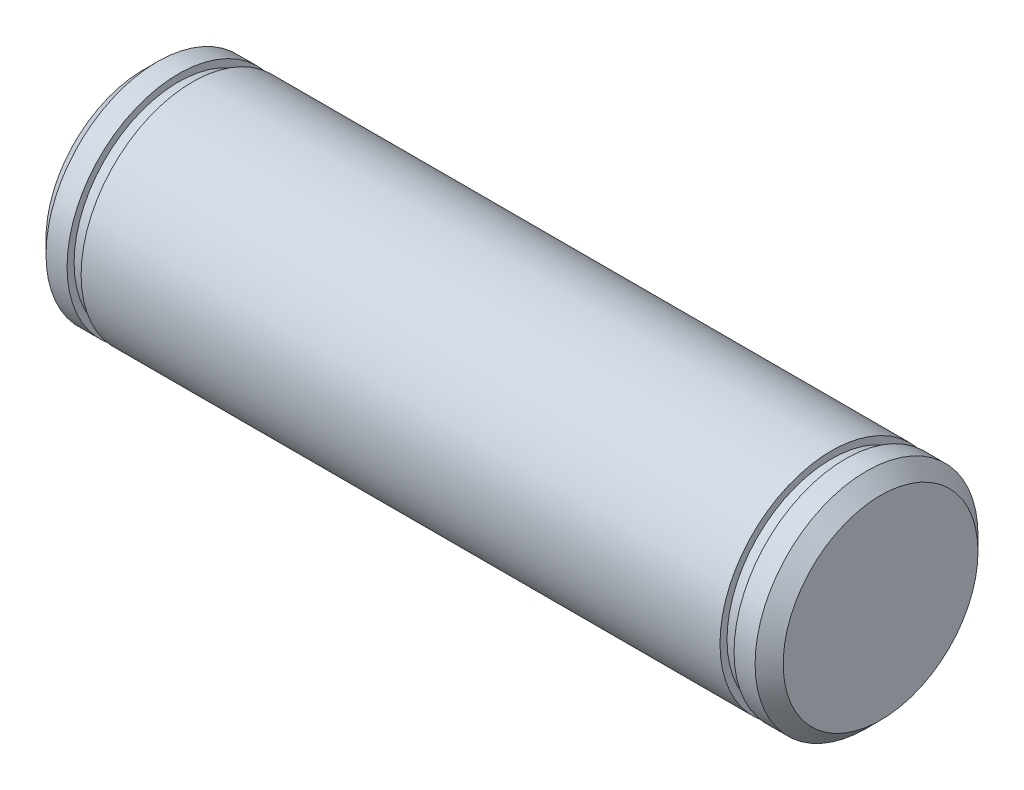
ISO-10303-21;
HEADER;
FILE_DESCRIPTION(('STEP AP214'),'2;1');
FILE_NAME('part.step','',(''),(''),'','','');
FILE_SCHEMA(('AUTOMOTIVE_DESIGN { 1 0 10303 214 1 1 1 1 }'));
ENDSEC;
DATA;
#1=APPLICATION_CONTEXT('core data for automotive mechanical design processes');
#2=APPLICATION_PROTOCOL_DEFINITION('international standard','automotive_design',2000,#1);
#3=PRODUCT_CONTEXT('',#1,'mechanical');
#4=PRODUCT('Part','Part','',(#3));
#5=PRODUCT_RELATED_PRODUCT_CATEGORY('part','',(#4));
#6=PRODUCT_DEFINITION_FORMATION('','',#4);
#7=PRODUCT_DEFINITION_CONTEXT('part definition',#1,'design');
#8=PRODUCT_DEFINITION('design','',#6,#7);
#9=PRODUCT_DEFINITION_SHAPE('','',#8);
#10=(LENGTH_UNIT() NAMED_UNIT(*) SI_UNIT(.MILLI.,.METRE.));
#11=(NAMED_UNIT(*) PLANE_ANGLE_UNIT() SI_UNIT($,.RADIAN.));
#12=(NAMED_UNIT(*) SI_UNIT($,.STERADIAN.) SOLID_ANGLE_UNIT());
#13=UNCERTAINTY_MEASURE_WITH_UNIT(LENGTH_MEASURE(1.E-05),#10,'distance_accuracy_value','');
#14=(GEOMETRIC_REPRESENTATION_CONTEXT(3) GLOBAL_UNCERTAINTY_ASSIGNED_CONTEXT((#13)) GLOBAL_UNIT_ASSIGNED_CONTEXT((#10,
#11,#12)) REPRESENTATION_CONTEXT('',''));
#15=CARTESIAN_POINT('',(0.,0.,0.));
#16=DIRECTION('',(0.,0.,1.));
#17=DIRECTION('',(1.,0.,0.));
#18=AXIS2_PLACEMENT_3D('',#15,#16,#17);
#19=CARTESIAN_POINT('',(52.5,0.,0.));
#20=DIRECTION('',(-1.,0.,0.));
#21=DIRECTION('',(0.,0.,1.));
#22=AXIS2_PLACEMENT_3D('',#19,#20,#21);
#23=CYLINDRICAL_SURFACE('',#22,15.875);
#24=CARTESIAN_POINT('',(-45.5,0.,0.));
#25=DIRECTION('',(-1.,0.,0.));
#26=DIRECTION('',(0.,0.,1.));
#27=AXIS2_PLACEMENT_3D('',#24,#25,#26);
#28=CIRCLE('',#27,15.875);
#29=CARTESIAN_POINT('',(-45.5,0.,15.875));
#30=VERTEX_POINT('',#29);
#31=EDGE_CURVE('E68',#30,#30,#28,.T.);
#32=ORIENTED_EDGE('',*,*,#31,.F.);
#33=EDGE_LOOP('',(#32));
#34=FACE_BOUND('',#33,.T.);
#35=CARTESIAN_POINT('',(45.5,0.,0.));
#36=DIRECTION('',(-1.,0.,0.));
#37=DIRECTION('',(0.,0.,1.));
#38=AXIS2_PLACEMENT_3D('',#35,#36,#37);
#39=CIRCLE('',#38,15.875);
#40=CARTESIAN_POINT('',(45.5,0.,15.875));
#41=VERTEX_POINT('',#40);
#42=EDGE_CURVE('E81',#41,#41,#39,.T.);
#43=ORIENTED_EDGE('',*,*,#42,.T.);
#44=EDGE_LOOP('',(#43));
#45=FACE_BOUND('',#44,.T.);
#46=ADVANCED_FACE('F43',(#34,#45),#23,.T.);
#47=CARTESIAN_POINT('',(-45.5,0.,0.));
#48=DIRECTION('',(-1.,0.,0.));
#49=DIRECTION('',(0.,0.,1.));
#50=AXIS2_PLACEMENT_3D('',#47,#48,#49);
#51=PLANE('',#50);
#52=CARTESIAN_POINT('',(-45.5,0.,0.));
#53=DIRECTION('',(-1.,0.,0.));
#54=DIRECTION('',(0.,0.,1.));
#55=AXIS2_PLACEMENT_3D('',#52,#53,#54);
#56=CIRCLE('',#55,14.875);
#57=CARTESIAN_POINT('',(-45.5,0.,14.875));
#58=VERTEX_POINT('',#57);
#59=EDGE_CURVE('E73',#58,#58,#56,.T.);
#60=ORIENTED_EDGE('',*,*,#59,.F.);
#61=EDGE_LOOP('',(#60));
#62=FACE_BOUND('',#61,.T.);
#63=ORIENTED_EDGE('',*,*,#31,.T.);
#64=EDGE_LOOP('',(#63));
#65=FACE_BOUND('',#64,.T.);
#66=ADVANCED_FACE('F122',(#62,#65),#51,.T.);
#67=CARTESIAN_POINT('',(-47.5,0.,0.));
#68=DIRECTION('',(-1.,0.,0.));
#69=DIRECTION('',(0.,0.,1.));
#70=AXIS2_PLACEMENT_3D('',#67,#68,#69);
#71=PLANE('',#70);
#72=CARTESIAN_POINT('',(-47.5,0.,0.));
#73=DIRECTION('',(-1.,0.,0.));
#74=DIRECTION('',(0.,0.,1.));
#75=AXIS2_PLACEMENT_3D('',#72,#73,#74);
#76=CIRCLE('',#75,14.875);
#77=CARTESIAN_POINT('',(-47.5,0.,14.875));
#78=VERTEX_POINT('',#77);
#79=EDGE_CURVE('E77',#78,#78,#76,.T.);
#80=ORIENTED_EDGE('',*,*,#79,.T.);
#81=EDGE_LOOP('',(#80));
#82=FACE_BOUND('',#81,.T.);
#83=CARTESIAN_POINT('',(-47.5,0.,0.));
#84=DIRECTION('',(-1.,0.,0.));
#85=DIRECTION('',(0.,0.,1.));
#86=AXIS2_PLACEMENT_3D('',#83,#84,#85);
#87=CIRCLE('',#86,15.875);
#88=CARTESIAN_POINT('',(-47.5,0.,15.875));
#89=VERTEX_POINT('',#88);
#90=EDGE_CURVE('E69',#89,#89,#87,.T.);
#91=ORIENTED_EDGE('',*,*,#90,.F.);
#92=EDGE_LOOP('',(#91));
#93=FACE_BOUND('',#92,.T.);
#94=ADVANCED_FACE('F129',(#82,#93),#71,.F.);
#95=CARTESIAN_POINT('',(-45.5,0.,0.));
#96=DIRECTION('',(-1.,0.,0.));
#97=DIRECTION('',(0.,0.,1.));
#98=AXIS2_PLACEMENT_3D('',#95,#96,#97);
#99=CYLINDRICAL_SURFACE('',#98,14.875);
#100=ORIENTED_EDGE('',*,*,#59,.T.);
#101=EDGE_LOOP('',(#100));
#102=FACE_BOUND('',#101,.T.);
#103=ORIENTED_EDGE('',*,*,#79,.F.);
#104=EDGE_LOOP('',(#103));
#105=FACE_BOUND('',#104,.T.);
#106=ADVANCED_FACE('F151',(#102,#105),#99,.T.);
#107=CARTESIAN_POINT('',(-52.5,0.,0.));
#108=DIRECTION('',(1.,0.,0.));
#109=DIRECTION('',(0.,0.,-1.));
#110=AXIS2_PLACEMENT_3D('',#107,#108,#109);
#111=PLANE('',#110);
#112=CARTESIAN_POINT('',(-52.5,0.,0.));
#113=DIRECTION('',(1.,0.,0.));
#114=DIRECTION('',(0.,0.,-1.));
#115=AXIS2_PLACEMENT_3D('',#112,#113,#114);
#116=CIRCLE('',#115,13.875);
#117=CARTESIAN_POINT('',(-52.5,0.,-13.875));
#118=VERTEX_POINT('',#117);
#119=EDGE_CURVE('E52',#118,#118,#116,.F.);
#120=ORIENTED_EDGE('',*,*,#119,.T.);
#121=EDGE_LOOP('',(#120));
#122=FACE_BOUND('',#121,.T.);
#123=ADVANCED_FACE('F143',(#122),#111,.F.);
#124=CARTESIAN_POINT('',(-50.5,0.,0.));
#125=DIRECTION('',(1.,0.,0.));
#126=DIRECTION('',(0.,0.,-1.));
#127=AXIS2_PLACEMENT_3D('',#124,#125,#126);
#128=CONICAL_SURFACE('',#127,15.875,0.785398163397453);
#129=ORIENTED_EDGE('',*,*,#119,.F.);
#130=EDGE_LOOP('',(#129));
#131=FACE_BOUND('',#130,.T.);
#132=CARTESIAN_POINT('',(-50.5,0.,0.));
#133=DIRECTION('',(1.,0.,0.));
#134=DIRECTION('',(0.,0.,-1.));
#135=AXIS2_PLACEMENT_3D('',#132,#133,#134);
#136=CIRCLE('',#135,15.875);
#137=CARTESIAN_POINT('',(-50.5,0.,-15.875));
#138=VERTEX_POINT('',#137);
#139=EDGE_CURVE('E57',#138,#138,#136,.T.);
#140=ORIENTED_EDGE('',*,*,#139,.F.);
#141=EDGE_LOOP('',(#140));
#142=FACE_BOUND('',#141,.T.);
#143=ADVANCED_FACE('F138',(#131,#142),#128,.T.);
#144=ORIENTED_EDGE('',*,*,#90,.T.);
#145=EDGE_LOOP('',(#144));
#146=FACE_BOUND('',#145,.T.);
#147=ORIENTED_EDGE('',*,*,#139,.T.);
#148=EDGE_LOOP('',(#147));
#149=FACE_BOUND('',#148,.T.);
#150=ADVANCED_FACE('F117',(#146,#149),#23,.T.);
#151=CARTESIAN_POINT('',(45.5,0.,0.));
#152=DIRECTION('',(1.,0.,0.));
#153=DIRECTION('',(0.,0.,1.));
#154=AXIS2_PLACEMENT_3D('',#151,#152,#153);
#155=PLANE('',#154);
#156=ORIENTED_EDGE('',*,*,#42,.F.);
#157=EDGE_LOOP('',(#156));
#158=FACE_BOUND('',#157,.T.);
#159=CARTESIAN_POINT('',(45.5,0.,0.));
#160=DIRECTION('',(-1.,0.,0.));
#161=DIRECTION('',(0.,0.,1.));
#162=AXIS2_PLACEMENT_3D('',#159,#160,#161);
#163=CIRCLE('',#162,14.875);
#164=CARTESIAN_POINT('',(45.5,0.,14.875));
#165=VERTEX_POINT('',#164);
#166=EDGE_CURVE('E89',#165,#165,#163,.T.);
#167=ORIENTED_EDGE('',*,*,#166,.T.);
#168=EDGE_LOOP('',(#167));
#169=FACE_BOUND('',#168,.T.);
#170=ADVANCED_FACE('F101',(#158,#169),#155,.T.);
#171=CARTESIAN_POINT('',(47.5,0.,0.));
#172=DIRECTION('',(1.,0.,0.));
#173=DIRECTION('',(0.,0.,1.));
#174=AXIS2_PLACEMENT_3D('',#171,#172,#173);
#175=PLANE('',#174);
#176=CARTESIAN_POINT('',(47.5,0.,0.));
#177=DIRECTION('',(-1.,0.,0.));
#178=DIRECTION('',(0.,0.,1.));
#179=AXIS2_PLACEMENT_3D('',#176,#177,#178);
#180=CIRCLE('',#179,15.875);
#181=CARTESIAN_POINT('',(47.5,0.,15.875));
#182=VERTEX_POINT('',#181);
#183=EDGE_CURVE('E85',#182,#182,#180,.T.);
#184=ORIENTED_EDGE('',*,*,#183,.T.);
#185=EDGE_LOOP('',(#184));
#186=FACE_BOUND('',#185,.T.);
#187=CARTESIAN_POINT('',(47.5,0.,0.));
#188=DIRECTION('',(-1.,0.,0.));
#189=DIRECTION('',(0.,0.,1.));
#190=AXIS2_PLACEMENT_3D('',#187,#188,#189);
#191=CIRCLE('',#190,14.875);
#192=CARTESIAN_POINT('',(47.5,0.,14.875));
#193=VERTEX_POINT('',#192);
#194=EDGE_CURVE('E93',#193,#193,#191,.T.);
#195=ORIENTED_EDGE('',*,*,#194,.F.);
#196=EDGE_LOOP('',(#195));
#197=FACE_BOUND('',#196,.T.);
#198=ADVANCED_FACE('F107',(#186,#197),#175,.F.);
#199=CARTESIAN_POINT('',(45.5,0.,0.));
#200=DIRECTION('',(1.,0.,0.));
#201=DIRECTION('',(0.,0.,-1.));
#202=AXIS2_PLACEMENT_3D('',#199,#200,#201);
#203=CYLINDRICAL_SURFACE('',#202,14.875);
#204=ORIENTED_EDGE('',*,*,#166,.F.);
#205=EDGE_LOOP('',(#204));
#206=FACE_BOUND('',#205,.T.);
#207=ORIENTED_EDGE('',*,*,#194,.T.);
#208=EDGE_LOOP('',(#207));
#209=FACE_BOUND('',#208,.T.);
#210=ADVANCED_FACE('F103',(#206,#209),#203,.T.);
#211=CARTESIAN_POINT('',(52.5,0.,0.));
#212=DIRECTION('',(1.,0.,0.));
#213=DIRECTION('',(0.,0.,-1.));
#214=AXIS2_PLACEMENT_3D('',#211,#212,#213);
#215=PLANE('',#214);
#216=CARTESIAN_POINT('',(52.5,0.,0.));
#217=DIRECTION('',(1.,0.,0.));
#218=DIRECTION('',(0.,0.,-1.));
#219=AXIS2_PLACEMENT_3D('',#216,#217,#218);
#220=CIRCLE('',#219,13.875);
#221=CARTESIAN_POINT('',(52.5,0.,-13.875));
#222=VERTEX_POINT('',#221);
#223=EDGE_CURVE('E10',#222,#222,#220,.T.);
#224=ORIENTED_EDGE('',*,*,#223,.T.);
#225=EDGE_LOOP('',(#224));
#226=FACE_BOUND('',#225,.T.);
#227=ADVANCED_FACE('F106',(#226),#215,.T.);
#228=CARTESIAN_POINT('',(52.5,0.,0.));
#229=DIRECTION('',(-1.,0.,0.));
#230=DIRECTION('',(0.,0.,1.));
#231=AXIS2_PLACEMENT_3D('',#228,#229,#230);
#232=CONICAL_SURFACE('',#231,13.875,0.785398163397447);
#233=CARTESIAN_POINT('',(50.5,0.,0.));
#234=DIRECTION('',(1.,0.,0.));
#235=DIRECTION('',(0.,0.,-1.));
#236=AXIS2_PLACEMENT_3D('',#233,#234,#235);
#237=CIRCLE('',#236,15.875);
#238=CARTESIAN_POINT('',(50.5,0.,-15.875));
#239=VERTEX_POINT('',#238);
#240=EDGE_CURVE('E62',#239,#239,#237,.F.);
#241=ORIENTED_EDGE('',*,*,#240,.F.);
#242=EDGE_LOOP('',(#241));
#243=FACE_BOUND('',#242,.T.);
#244=ORIENTED_EDGE('',*,*,#223,.F.);
#245=EDGE_LOOP('',(#244));
#246=FACE_BOUND('',#245,.T.);
#247=ADVANCED_FACE('F46',(#243,#246),#232,.T.);
#248=ORIENTED_EDGE('',*,*,#183,.F.);
#249=EDGE_LOOP('',(#248));
#250=FACE_BOUND('',#249,.T.);
#251=ORIENTED_EDGE('',*,*,#240,.T.);
#252=EDGE_LOOP('',(#251));
#253=FACE_BOUND('',#252,.T.);
#254=ADVANCED_FACE('F125',(#250,#253),#23,.T.);
#255=CLOSED_SHELL('',(#46,#66,#94,#106,#123,#143,#150,#170,#198,#210,#227,#247,#254));
#256=MANIFOLD_SOLID_BREP('B2',#255);
#257=ADVANCED_BREP_SHAPE_REPRESENTATION('',(#18,#256),#14);
#258=SHAPE_DEFINITION_REPRESENTATION(#9,#257);
ENDSEC;
END-ISO-10303-21;
